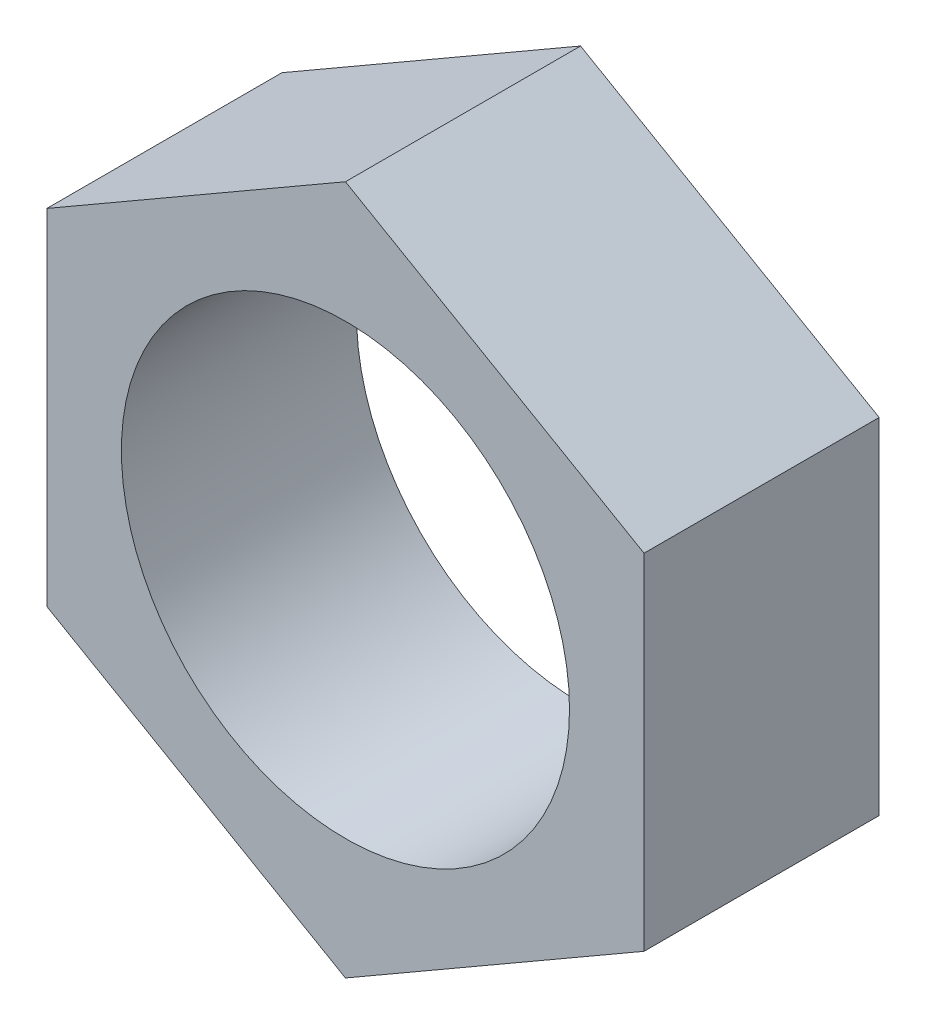
ISO-10303-21;
HEADER;
FILE_DESCRIPTION(('STEP AP214'),'2;1');
FILE_NAME('part.step','',(''),(''),'','','');
FILE_SCHEMA(('AUTOMOTIVE_DESIGN { 1 0 10303 214 1 1 1 1 }'));
ENDSEC;
DATA;
#1=APPLICATION_CONTEXT('core data for automotive mechanical design processes');
#2=APPLICATION_PROTOCOL_DEFINITION('international standard','automotive_design',2000,#1);
#3=PRODUCT_CONTEXT('',#1,'mechanical');
#4=PRODUCT('Part','Part','',(#3));
#5=PRODUCT_RELATED_PRODUCT_CATEGORY('part','',(#4));
#6=PRODUCT_DEFINITION_FORMATION('','',#4);
#7=PRODUCT_DEFINITION_CONTEXT('part definition',#1,'design');
#8=PRODUCT_DEFINITION('design','',#6,#7);
#9=PRODUCT_DEFINITION_SHAPE('','',#8);
#10=(LENGTH_UNIT() NAMED_UNIT(*) SI_UNIT(.MILLI.,.METRE.));
#11=(NAMED_UNIT(*) PLANE_ANGLE_UNIT() SI_UNIT($,.RADIAN.));
#12=(NAMED_UNIT(*) SI_UNIT($,.STERADIAN.) SOLID_ANGLE_UNIT());
#13=UNCERTAINTY_MEASURE_WITH_UNIT(LENGTH_MEASURE(1.E-05),#10,'distance_accuracy_value','');
#14=(GEOMETRIC_REPRESENTATION_CONTEXT(3) GLOBAL_UNCERTAINTY_ASSIGNED_CONTEXT((#13)) GLOBAL_UNIT_ASSIGNED_CONTEXT((#10,
#11,#12)) REPRESENTATION_CONTEXT('',''));
#15=CARTESIAN_POINT('',(0.,0.,0.));
#16=DIRECTION('',(0.,0.,1.));
#17=DIRECTION('',(1.,0.,0.));
#18=AXIS2_PLACEMENT_3D('',#15,#16,#17);
#19=CARTESIAN_POINT('',(0.,0.,5.));
#20=DIRECTION('',(0.,0.,1.));
#21=DIRECTION('',(1.,0.,0.));
#22=AXIS2_PLACEMENT_3D('',#19,#20,#21);
#23=PLANE('',#22);
#24=DIRECTION('',(0.,-1.,0.));
#25=VECTOR('',#24,1.);
#26=CARTESIAN_POINT('',(-6.35,3.66617420935412,5.));
#27=LINE('',#26,#25);
#28=CARTESIAN_POINT('',(-6.35,3.66617420935412,5.));
#29=VERTEX_POINT('',#28);
#30=CARTESIAN_POINT('',(-6.35,-3.66617420935412,5.));
#31=VERTEX_POINT('',#30);
#32=EDGE_CURVE('E146',#29,#31,#27,.T.);
#33=ORIENTED_EDGE('',*,*,#32,.T.);
#34=DIRECTION('',(0.866025403784439,-0.5,0.));
#35=VECTOR('',#34,1.);
#36=CARTESIAN_POINT('',(-6.35,-3.66617420935412,5.));
#37=LINE('',#36,#35);
#38=CARTESIAN_POINT('',(0.,-7.33234841870824,5.));
#39=VERTEX_POINT('',#38);
#40=EDGE_CURVE('E94',#31,#39,#37,.T.);
#41=ORIENTED_EDGE('',*,*,#40,.T.);
#42=DIRECTION('',(0.866025403784438,0.5,0.));
#43=VECTOR('',#42,1.);
#44=CARTESIAN_POINT('',(0.,-7.33234841870824,5.));
#45=LINE('',#44,#43);
#46=CARTESIAN_POINT('',(6.35,-3.66617420935412,5.));
#47=VERTEX_POINT('',#46);
#48=EDGE_CURVE('E107',#39,#47,#45,.T.);
#49=ORIENTED_EDGE('',*,*,#48,.T.);
#50=DIRECTION('',(0.,1.,0.));
#51=VECTOR('',#50,1.);
#52=CARTESIAN_POINT('',(6.35,-3.66617420935412,5.));
#53=LINE('',#52,#51);
#54=CARTESIAN_POINT('',(6.34999999999999,3.66617420935413,5.));
#55=VERTEX_POINT('',#54);
#56=EDGE_CURVE('E101',#47,#55,#53,.T.);
#57=ORIENTED_EDGE('',*,*,#56,.T.);
#58=DIRECTION('',(-0.866025403784439,0.5,0.));
#59=VECTOR('',#58,1.);
#60=CARTESIAN_POINT('',(6.34999999999999,3.66617420935413,5.));
#61=LINE('',#60,#59);
#62=CARTESIAN_POINT('',(0.,7.33234841870824,5.));
#63=VERTEX_POINT('',#62);
#64=EDGE_CURVE('E105',#55,#63,#61,.T.);
#65=ORIENTED_EDGE('',*,*,#64,.T.);
#66=DIRECTION('',(-0.866025403784438,-0.5,0.));
#67=VECTOR('',#66,1.);
#68=CARTESIAN_POINT('',(0.,7.33234841870824,5.));
#69=LINE('',#68,#67);
#70=EDGE_CURVE('E57',#63,#29,#69,.T.);
#71=ORIENTED_EDGE('',*,*,#70,.T.);
#72=EDGE_LOOP('',(#33,#41,#49,#57,#65,#71));
#73=FACE_BOUND('',#72,.T.);
#74=CARTESIAN_POINT('',(0.,0.,5.));
#75=DIRECTION('',(0.,0.,1.));
#76=DIRECTION('',(1.,0.,0.));
#77=AXIS2_PLACEMENT_3D('',#74,#75,#76);
#78=CIRCLE('',#77,4.765);
#79=CARTESIAN_POINT('',(4.765,0.,5.));
#80=VERTEX_POINT('',#79);
#81=EDGE_CURVE('E134',#80,#80,#78,.T.);
#82=ORIENTED_EDGE('',*,*,#81,.F.);
#83=EDGE_LOOP('',(#82));
#84=FACE_BOUND('',#83,.T.);
#85=ADVANCED_FACE('F39',(#73,#84),#23,.T.);
#86=CARTESIAN_POINT('',(0.,0.,0.));
#87=DIRECTION('',(0.,0.,1.));
#88=DIRECTION('',(1.,0.,0.));
#89=AXIS2_PLACEMENT_3D('',#86,#87,#88);
#90=PLANE('',#89);
#91=DIRECTION('',(0.,-1.,0.));
#92=VECTOR('',#91,1.);
#93=CARTESIAN_POINT('',(-6.35,3.66617420935412,0.));
#94=LINE('',#93,#92);
#95=CARTESIAN_POINT('',(-6.35,3.66617420935412,0.));
#96=VERTEX_POINT('',#95);
#97=CARTESIAN_POINT('',(-6.35,-3.66617420935412,0.));
#98=VERTEX_POINT('',#97);
#99=EDGE_CURVE('E129',#96,#98,#94,.T.);
#100=ORIENTED_EDGE('',*,*,#99,.F.);
#101=DIRECTION('',(-0.866025403784438,-0.5,0.));
#102=VECTOR('',#101,1.);
#103=CARTESIAN_POINT('',(0.,7.33234841870824,0.));
#104=LINE('',#103,#102);
#105=CARTESIAN_POINT('',(0.,7.33234841870824,0.));
#106=VERTEX_POINT('',#105);
#107=EDGE_CURVE('E86',#106,#96,#104,.T.);
#108=ORIENTED_EDGE('',*,*,#107,.F.);
#109=DIRECTION('',(-0.866025403784439,0.5,0.));
#110=VECTOR('',#109,1.);
#111=CARTESIAN_POINT('',(6.34999999999999,3.66617420935413,0.));
#112=LINE('',#111,#110);
#113=CARTESIAN_POINT('',(6.34999999999999,3.66617420935413,0.));
#114=VERTEX_POINT('',#113);
#115=EDGE_CURVE('E80',#114,#106,#112,.T.);
#116=ORIENTED_EDGE('',*,*,#115,.F.);
#117=DIRECTION('',(0.,1.,0.));
#118=VECTOR('',#117,1.);
#119=CARTESIAN_POINT('',(6.35,-3.66617420935412,0.));
#120=LINE('',#119,#118);
#121=CARTESIAN_POINT('',(6.35,-3.66617420935412,0.));
#122=VERTEX_POINT('',#121);
#123=EDGE_CURVE('E116',#122,#114,#120,.T.);
#124=ORIENTED_EDGE('',*,*,#123,.F.);
#125=DIRECTION('',(0.866025403784438,0.5,0.));
#126=VECTOR('',#125,1.);
#127=CARTESIAN_POINT('',(0.,-7.33234841870824,0.));
#128=LINE('',#127,#126);
#129=CARTESIAN_POINT('',(0.,-7.33234841870824,0.));
#130=VERTEX_POINT('',#129);
#131=EDGE_CURVE('E137',#130,#122,#128,.T.);
#132=ORIENTED_EDGE('',*,*,#131,.F.);
#133=DIRECTION('',(0.866025403784439,-0.5,0.));
#134=VECTOR('',#133,1.);
#135=CARTESIAN_POINT('',(-6.35,-3.66617420935412,0.));
#136=LINE('',#135,#134);
#137=EDGE_CURVE('E133',#98,#130,#136,.T.);
#138=ORIENTED_EDGE('',*,*,#137,.F.);
#139=EDGE_LOOP('',(#100,#108,#116,#124,#132,#138));
#140=FACE_BOUND('',#139,.T.);
#141=CARTESIAN_POINT('',(0.,0.,0.));
#142=DIRECTION('',(0.,0.,1.));
#143=DIRECTION('',(1.,0.,0.));
#144=AXIS2_PLACEMENT_3D('',#141,#142,#143);
#145=CIRCLE('',#144,4.765);
#146=CARTESIAN_POINT('',(4.765,0.,0.));
#147=VERTEX_POINT('',#146);
#148=EDGE_CURVE('E243',#147,#147,#145,.T.);
#149=ORIENTED_EDGE('',*,*,#148,.T.);
#150=EDGE_LOOP('',(#149));
#151=FACE_BOUND('',#150,.T.);
#152=ADVANCED_FACE('F159',(#140,#151),#90,.F.);
#153=CARTESIAN_POINT('',(-6.35,3.66617420935412,5.));
#154=DIRECTION('',(1.,0.,0.));
#155=DIRECTION('',(0.,1.,0.));
#156=AXIS2_PLACEMENT_3D('',#153,#154,#155);
#157=PLANE('',#156);
#158=ORIENTED_EDGE('',*,*,#99,.T.);
#159=DIRECTION('',(0.,0.,-1.));
#160=VECTOR('',#159,1.);
#161=CARTESIAN_POINT('',(-6.35,-3.66617420935412,5.));
#162=LINE('',#161,#160);
#163=EDGE_CURVE('E11',#31,#98,#162,.T.);
#164=ORIENTED_EDGE('',*,*,#163,.F.);
#165=ORIENTED_EDGE('',*,*,#32,.F.);
#166=DIRECTION('',(0.,0.,-1.));
#167=VECTOR('',#166,1.);
#168=CARTESIAN_POINT('',(-6.35,3.66617420935412,5.));
#169=LINE('',#168,#167);
#170=EDGE_CURVE('E125',#29,#96,#169,.T.);
#171=ORIENTED_EDGE('',*,*,#170,.T.);
#172=EDGE_LOOP('',(#158,#164,#165,#171));
#173=FACE_BOUND('',#172,.T.);
#174=ADVANCED_FACE('F41',(#173),#157,.F.);
#175=CARTESIAN_POINT('',(-6.35,-3.66617420935412,5.));
#176=DIRECTION('',(0.5,0.866025403784439,0.));
#177=DIRECTION('',(-0.866025403784439,0.5,0.));
#178=AXIS2_PLACEMENT_3D('',#175,#176,#177);
#179=PLANE('',#178);
#180=ORIENTED_EDGE('',*,*,#137,.T.);
#181=DIRECTION('',(0.,0.,-1.));
#182=VECTOR('',#181,1.);
#183=CARTESIAN_POINT('',(0.,-7.33234841870824,5.));
#184=LINE('',#183,#182);
#185=EDGE_CURVE('E49',#39,#130,#184,.T.);
#186=ORIENTED_EDGE('',*,*,#185,.F.);
#187=ORIENTED_EDGE('',*,*,#40,.F.);
#188=ORIENTED_EDGE('',*,*,#163,.T.);
#189=EDGE_LOOP('',(#180,#186,#187,#188));
#190=FACE_BOUND('',#189,.T.);
#191=ADVANCED_FACE('F184',(#190),#179,.F.);
#192=CARTESIAN_POINT('',(0.,-7.33234841870824,5.));
#193=DIRECTION('',(-0.5,0.866025403784438,0.));
#194=DIRECTION('',(-0.866025403784438,-0.5,0.));
#195=AXIS2_PLACEMENT_3D('',#192,#193,#194);
#196=PLANE('',#195);
#197=ORIENTED_EDGE('',*,*,#131,.T.);
#198=DIRECTION('',(0.,0.,-1.));
#199=VECTOR('',#198,1.);
#200=CARTESIAN_POINT('',(6.35,-3.66617420935412,5.));
#201=LINE('',#200,#199);
#202=EDGE_CURVE('E118',#47,#122,#201,.T.);
#203=ORIENTED_EDGE('',*,*,#202,.F.);
#204=ORIENTED_EDGE('',*,*,#48,.F.);
#205=ORIENTED_EDGE('',*,*,#185,.T.);
#206=EDGE_LOOP('',(#197,#203,#204,#205));
#207=FACE_BOUND('',#206,.T.);
#208=ADVANCED_FACE('F156',(#207),#196,.F.);
#209=CARTESIAN_POINT('',(6.35,-3.66617420935412,5.));
#210=DIRECTION('',(-1.,0.,0.));
#211=DIRECTION('',(0.,-1.,0.));
#212=AXIS2_PLACEMENT_3D('',#209,#210,#211);
#213=PLANE('',#212);
#214=ORIENTED_EDGE('',*,*,#123,.T.);
#215=DIRECTION('',(0.,0.,-1.));
#216=VECTOR('',#215,1.);
#217=CARTESIAN_POINT('',(6.34999999999999,3.66617420935413,5.));
#218=LINE('',#217,#216);
#219=EDGE_CURVE('E113',#55,#114,#218,.T.);
#220=ORIENTED_EDGE('',*,*,#219,.F.);
#221=ORIENTED_EDGE('',*,*,#56,.F.);
#222=ORIENTED_EDGE('',*,*,#202,.T.);
#223=EDGE_LOOP('',(#214,#220,#221,#222));
#224=FACE_BOUND('',#223,.T.);
#225=ADVANCED_FACE('F114',(#224),#213,.F.);
#226=CARTESIAN_POINT('',(6.34999999999999,3.66617420935413,5.));
#227=DIRECTION('',(-0.5,-0.866025403784439,0.));
#228=DIRECTION('',(0.866025403784439,-0.5,0.));
#229=AXIS2_PLACEMENT_3D('',#226,#227,#228);
#230=PLANE('',#229);
#231=ORIENTED_EDGE('',*,*,#115,.T.);
#232=DIRECTION('',(0.,0.,-1.));
#233=VECTOR('',#232,1.);
#234=CARTESIAN_POINT('',(0.,7.33234841870824,5.));
#235=LINE('',#234,#233);
#236=EDGE_CURVE('E119',#63,#106,#235,.T.);
#237=ORIENTED_EDGE('',*,*,#236,.F.);
#238=ORIENTED_EDGE('',*,*,#64,.F.);
#239=ORIENTED_EDGE('',*,*,#219,.T.);
#240=EDGE_LOOP('',(#231,#237,#238,#239));
#241=FACE_BOUND('',#240,.T.);
#242=ADVANCED_FACE('F121',(#241),#230,.F.);
#243=CARTESIAN_POINT('',(0.,7.33234841870824,5.));
#244=DIRECTION('',(0.5,-0.866025403784439,0.));
#245=DIRECTION('',(0.866025403784439,0.5,0.));
#246=AXIS2_PLACEMENT_3D('',#243,#244,#245);
#247=PLANE('',#246);
#248=ORIENTED_EDGE('',*,*,#107,.T.);
#249=ORIENTED_EDGE('',*,*,#170,.F.);
#250=ORIENTED_EDGE('',*,*,#70,.F.);
#251=ORIENTED_EDGE('',*,*,#236,.T.);
#252=EDGE_LOOP('',(#248,#249,#250,#251));
#253=FACE_BOUND('',#252,.T.);
#254=ADVANCED_FACE('F164',(#253),#247,.F.);
#255=CARTESIAN_POINT('',(0.,0.,5.));
#256=DIRECTION('',(0.,0.,-1.));
#257=DIRECTION('',(-1.,0.,0.));
#258=AXIS2_PLACEMENT_3D('',#255,#256,#257);
#259=CYLINDRICAL_SURFACE('',#258,4.765);
#260=ORIENTED_EDGE('',*,*,#81,.T.);
#261=EDGE_LOOP('',(#260));
#262=FACE_BOUND('',#261,.T.);
#263=ORIENTED_EDGE('',*,*,#148,.F.);
#264=EDGE_LOOP('',(#263));
#265=FACE_BOUND('',#264,.T.);
#266=ADVANCED_FACE('F166',(#262,#265),#259,.F.);
#267=CLOSED_SHELL('',(#85,#152,#174,#191,#208,#225,#242,#254,#266));
#268=MANIFOLD_SOLID_BREP('B2',#267);
#269=ADVANCED_BREP_SHAPE_REPRESENTATION('',(#18,#268),#14);
#270=SHAPE_DEFINITION_REPRESENTATION(#9,#269);
ENDSEC;
END-ISO-10303-21;
